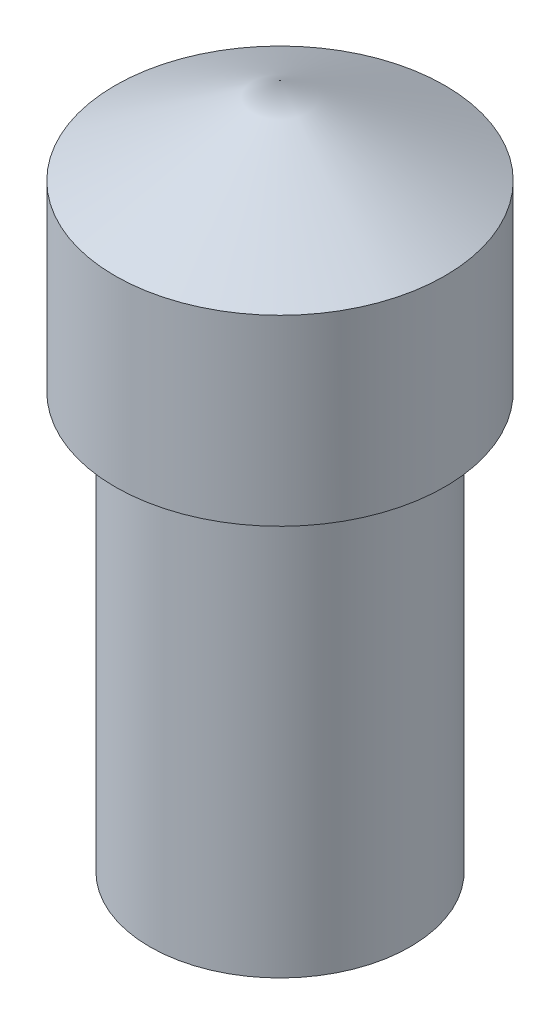
ISO-10303-21;
HEADER;
FILE_DESCRIPTION(('STEP AP214'),'2;1');
FILE_NAME('part.step','',(''),(''),'','','');
FILE_SCHEMA(('AUTOMOTIVE_DESIGN { 1 0 10303 214 1 1 1 1 }'));
ENDSEC;
DATA;
#1=APPLICATION_CONTEXT('core data for automotive mechanical design processes');
#2=APPLICATION_PROTOCOL_DEFINITION('international standard','automotive_design',2000,#1);
#3=PRODUCT_CONTEXT('',#1,'mechanical');
#4=PRODUCT('Part','Part','',(#3));
#5=PRODUCT_RELATED_PRODUCT_CATEGORY('part','',(#4));
#6=PRODUCT_DEFINITION_FORMATION('','',#4);
#7=PRODUCT_DEFINITION_CONTEXT('part definition',#1,'design');
#8=PRODUCT_DEFINITION('design','',#6,#7);
#9=PRODUCT_DEFINITION_SHAPE('','',#8);
#10=(LENGTH_UNIT() NAMED_UNIT(*) SI_UNIT(.MILLI.,.METRE.));
#11=(NAMED_UNIT(*) PLANE_ANGLE_UNIT() SI_UNIT($,.RADIAN.));
#12=(NAMED_UNIT(*) SI_UNIT($,.STERADIAN.) SOLID_ANGLE_UNIT());
#13=UNCERTAINTY_MEASURE_WITH_UNIT(LENGTH_MEASURE(1.E-05),#10,'distance_accuracy_value','');
#14=(GEOMETRIC_REPRESENTATION_CONTEXT(3) GLOBAL_UNCERTAINTY_ASSIGNED_CONTEXT((#13)) GLOBAL_UNIT_ASSIGNED_CONTEXT((#10,
#11,#12)) REPRESENTATION_CONTEXT('',''));
#15=CARTESIAN_POINT('',(0.,0.,0.));
#16=DIRECTION('',(0.,0.,1.));
#17=DIRECTION('',(1.,0.,0.));
#18=AXIS2_PLACEMENT_3D('',#15,#16,#17);
#19=CARTESIAN_POINT('',(0.,0.,0.));
#20=DIRECTION('',(0.,1.,0.));
#21=DIRECTION('',(0.,0.,1.));
#22=AXIS2_PLACEMENT_3D('',#19,#20,#21);
#23=PLANE('',#22);
#24=CARTESIAN_POINT('',(0.,0.,0.));
#25=DIRECTION('',(0.,1.,0.));
#26=DIRECTION('',(0.,0.,1.));
#27=AXIS2_PLACEMENT_3D('',#24,#25,#26);
#28=CIRCLE('',#27,0.75);
#29=CARTESIAN_POINT('',(0.,0.,0.75));
#30=VERTEX_POINT('',#29);
#31=EDGE_CURVE('E11',#30,#30,#28,.T.);
#32=ORIENTED_EDGE('',*,*,#31,.F.);
#33=EDGE_LOOP('',(#32));
#34=FACE_BOUND('',#33,.T.);
#35=ADVANCED_FACE('F34',(#34),#23,.F.);
#36=CARTESIAN_POINT('',(0.,3.94736842105264,0.));
#37=DIRECTION('',(0.,1.,0.));
#38=DIRECTION('',(0.,0.,1.));
#39=AXIS2_PLACEMENT_3D('',#36,#37,#38);
#40=CYLINDRICAL_SURFACE('',#39,0.75);
#41=CARTESIAN_POINT('',(0.,2.39473684210527,0.));
#42=DIRECTION('',(0.,1.,0.));
#43=DIRECTION('',(0.,0.,1.));
#44=AXIS2_PLACEMENT_3D('',#41,#42,#43);
#45=CIRCLE('',#44,0.75);
#46=CARTESIAN_POINT('',(0.,2.39473684210527,0.75));
#47=VERTEX_POINT('',#46);
#48=EDGE_CURVE('E40',#47,#47,#45,.T.);
#49=ORIENTED_EDGE('',*,*,#48,.F.);
#50=EDGE_LOOP('',(#49));
#51=FACE_BOUND('',#50,.T.);
#52=ORIENTED_EDGE('',*,*,#31,.T.);
#53=EDGE_LOOP('',(#52));
#54=FACE_BOUND('',#53,.T.);
#55=ADVANCED_FACE('F61',(#51,#54),#40,.T.);
#56=CARTESIAN_POINT('',(0.75,2.39473684210527,0.));
#57=DIRECTION('',(0.,1.,0.));
#58=DIRECTION('',(0.,0.,1.));
#59=AXIS2_PLACEMENT_3D('',#56,#57,#58);
#60=PLANE('',#59);
#61=CARTESIAN_POINT('',(0.,2.39473684210527,0.));
#62=DIRECTION('',(0.,1.,0.));
#63=DIRECTION('',(0.,0.,1.));
#64=AXIS2_PLACEMENT_3D('',#61,#62,#63);
#65=CIRCLE('',#64,0.95);
#66=CARTESIAN_POINT('',(0.,2.39473684210527,0.95));
#67=VERTEX_POINT('',#66);
#68=EDGE_CURVE('E52',#67,#67,#65,.T.);
#69=ORIENTED_EDGE('',*,*,#68,.F.);
#70=EDGE_LOOP('',(#69));
#71=FACE_BOUND('',#70,.T.);
#72=ORIENTED_EDGE('',*,*,#48,.T.);
#73=EDGE_LOOP('',(#72));
#74=FACE_BOUND('',#73,.T.);
#75=ADVANCED_FACE('F59',(#71,#74),#60,.F.);
#76=CARTESIAN_POINT('',(0.,3.94736842105264,0.));
#77=DIRECTION('',(0.,1.,0.));
#78=DIRECTION('',(0.,0.,1.));
#79=AXIS2_PLACEMENT_3D('',#76,#77,#78);
#80=CYLINDRICAL_SURFACE('',#79,0.95);
#81=CARTESIAN_POINT('',(0.,3.44736842105264,0.));
#82=DIRECTION('',(0.,1.,0.));
#83=DIRECTION('',(0.,0.,1.));
#84=AXIS2_PLACEMENT_3D('',#81,#82,#83);
#85=CIRCLE('',#84,0.95);
#86=CARTESIAN_POINT('',(0.,3.44736842105264,0.95));
#87=VERTEX_POINT('',#86);
#88=EDGE_CURVE('E50',#87,#87,#85,.T.);
#89=ORIENTED_EDGE('',*,*,#88,.F.);
#90=EDGE_LOOP('',(#89));
#91=FACE_BOUND('',#90,.T.);
#92=ORIENTED_EDGE('',*,*,#68,.T.);
#93=EDGE_LOOP('',(#92));
#94=FACE_BOUND('',#93,.T.);
#95=ADVANCED_FACE('F46',(#91,#94),#80,.T.);
#96=CARTESIAN_POINT('',(0.,3.44736842105264,0.));
#97=DIRECTION('',(0.,-1.,0.));
#98=DIRECTION('',(0.,0.,-1.));
#99=AXIS2_PLACEMENT_3D('',#96,#97,#98);
#100=CONICAL_SURFACE('',#99,0.95,1.08631839775787);
#101=CARTESIAN_POINT('',(0.,3.94736842105264,0.));
#102=VERTEX_POINT('',#101);
#103=VERTEX_LOOP('',#102);
#104=FACE_BOUND('',#103,.T.);
#105=ORIENTED_EDGE('',*,*,#88,.T.);
#106=EDGE_LOOP('',(#105));
#107=FACE_BOUND('',#106,.T.);
#108=ADVANCED_FACE('F43',(#104,#107),#100,.T.);
#109=CLOSED_SHELL('',(#35,#55,#75,#95,#108));
#110=MANIFOLD_SOLID_BREP('B2',#109);
#111=ADVANCED_BREP_SHAPE_REPRESENTATION('',(#18,#110),#14);
#112=SHAPE_DEFINITION_REPRESENTATION(#9,#111);
ENDSEC;
END-ISO-10303-21;
